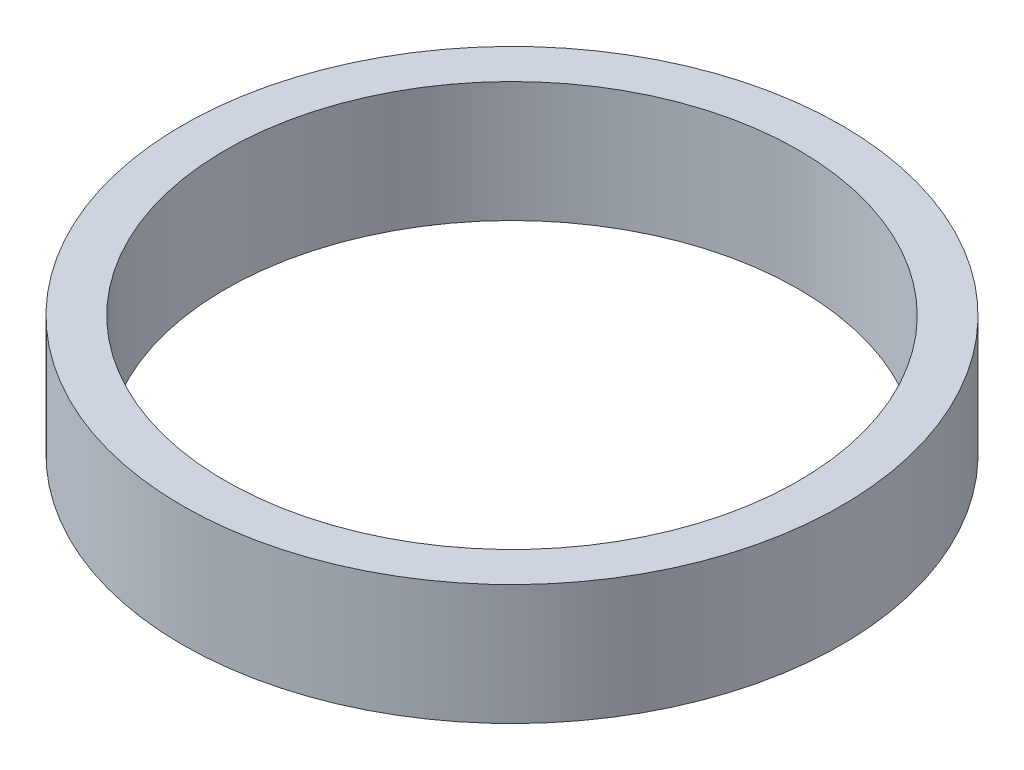
ISO-10303-21;
HEADER;
FILE_DESCRIPTION(('STEP AP214'),'2;1');
FILE_NAME('part.step','',(''),(''),'','','');
FILE_SCHEMA(('AUTOMOTIVE_DESIGN { 1 0 10303 214 1 1 1 1 }'));
ENDSEC;
DATA;
#1=APPLICATION_CONTEXT('core data for automotive mechanical design processes');
#2=APPLICATION_PROTOCOL_DEFINITION('international standard','automotive_design',2000,#1);
#3=PRODUCT_CONTEXT('',#1,'mechanical');
#4=PRODUCT('Part','Part','',(#3));
#5=PRODUCT_RELATED_PRODUCT_CATEGORY('part','',(#4));
#6=PRODUCT_DEFINITION_FORMATION('','',#4);
#7=PRODUCT_DEFINITION_CONTEXT('part definition',#1,'design');
#8=PRODUCT_DEFINITION('design','',#6,#7);
#9=PRODUCT_DEFINITION_SHAPE('','',#8);
#10=(LENGTH_UNIT() NAMED_UNIT(*) SI_UNIT(.MILLI.,.METRE.));
#11=(NAMED_UNIT(*) PLANE_ANGLE_UNIT() SI_UNIT($,.RADIAN.));
#12=(NAMED_UNIT(*) SI_UNIT($,.STERADIAN.) SOLID_ANGLE_UNIT());
#13=UNCERTAINTY_MEASURE_WITH_UNIT(LENGTH_MEASURE(1.E-05),#10,'distance_accuracy_value','');
#14=(GEOMETRIC_REPRESENTATION_CONTEXT(3) GLOBAL_UNCERTAINTY_ASSIGNED_CONTEXT((#13)) GLOBAL_UNIT_ASSIGNED_CONTEXT((#10,
#11,#12)) REPRESENTATION_CONTEXT('',''));
#15=CARTESIAN_POINT('',(0.,0.,0.));
#16=DIRECTION('',(0.,0.,1.));
#17=DIRECTION('',(1.,0.,0.));
#18=AXIS2_PLACEMENT_3D('',#15,#16,#17);
#19=CARTESIAN_POINT('',(0.,21.,0.));
#20=DIRECTION('',(0.,-1.,0.));
#21=DIRECTION('',(0.,0.,-1.));
#22=AXIS2_PLACEMENT_3D('',#19,#20,#21);
#23=CYLINDRICAL_SURFACE('',#22,57.5);
#24=CARTESIAN_POINT('',(0.,21.,0.));
#25=DIRECTION('',(0.,1.,0.));
#26=DIRECTION('',(0.,0.,1.));
#27=AXIS2_PLACEMENT_3D('',#24,#25,#26);
#28=CIRCLE('',#27,57.5);
#29=CARTESIAN_POINT('',(0.,21.,-57.5));
#30=VERTEX_POINT('',#29);
#31=EDGE_CURVE('E10',#30,#30,#28,.T.);
#32=CARTESIAN_POINT('',(0.,0.,0.));
#33=DIRECTION('',(0.,1.,0.));
#34=DIRECTION('',(0.,0.,1.));
#35=AXIS2_PLACEMENT_3D('',#32,#33,#34);
#36=CIRCLE('',#35,57.5);
#37=CARTESIAN_POINT('',(0.,0.,-57.5));
#38=VERTEX_POINT('',#37);
#39=EDGE_CURVE('E37',#38,#38,#36,.T.);
#40=CARTESIAN_POINT('',(0.,21.,-57.5));
#41=CARTESIAN_POINT('',(0.,20.78125,-57.5));
#42=CARTESIAN_POINT('',(0.,20.5625,-57.5));
#43=CARTESIAN_POINT('',(0.,20.125,-57.5));
#44=CARTESIAN_POINT('',(0.,19.90625,-57.5));
#45=CARTESIAN_POINT('',(0.,19.46875,-57.5));
#46=CARTESIAN_POINT('',(0.,19.25,-57.5));
#47=CARTESIAN_POINT('',(0.,18.8125,-57.5));
#48=CARTESIAN_POINT('',(0.,18.59375,-57.5));
#49=CARTESIAN_POINT('',(0.,18.15625,-57.5));
#50=CARTESIAN_POINT('',(0.,17.9375,-57.5));
#51=CARTESIAN_POINT('',(0.,17.5,-57.5));
#52=CARTESIAN_POINT('',(0.,17.28125,-57.5));
#53=CARTESIAN_POINT('',(0.,16.84375,-57.5));
#54=CARTESIAN_POINT('',(0.,16.625,-57.5));
#55=CARTESIAN_POINT('',(0.,16.1875,-57.5));
#56=CARTESIAN_POINT('',(0.,15.96875,-57.5));
#57=CARTESIAN_POINT('',(0.,15.53125,-57.5));
#58=CARTESIAN_POINT('',(0.,15.3125,-57.5));
#59=CARTESIAN_POINT('',(0.,14.875,-57.5));
#60=CARTESIAN_POINT('',(0.,14.65625,-57.5));
#61=CARTESIAN_POINT('',(0.,14.21875,-57.5));
#62=CARTESIAN_POINT('',(0.,14.,-57.5));
#63=CARTESIAN_POINT('',(0.,13.5625,-57.5));
#64=CARTESIAN_POINT('',(0.,13.34375,-57.5));
#65=CARTESIAN_POINT('',(0.,12.90625,-57.5));
#66=CARTESIAN_POINT('',(0.,12.6875,-57.5));
#67=CARTESIAN_POINT('',(0.,12.25,-57.5));
#68=CARTESIAN_POINT('',(0.,12.03125,-57.5));
#69=CARTESIAN_POINT('',(0.,11.59375,-57.5));
#70=CARTESIAN_POINT('',(0.,11.375,-57.5));
#71=CARTESIAN_POINT('',(0.,10.9375,-57.5));
#72=CARTESIAN_POINT('',(0.,10.71875,-57.5));
#73=CARTESIAN_POINT('',(0.,10.28125,-57.5));
#74=CARTESIAN_POINT('',(0.,10.0625,-57.5));
#75=CARTESIAN_POINT('',(0.,9.625,-57.5));
#76=CARTESIAN_POINT('',(0.,9.40625,-57.5));
#77=CARTESIAN_POINT('',(0.,8.96875,-57.5));
#78=CARTESIAN_POINT('',(0.,8.75,-57.5));
#79=CARTESIAN_POINT('',(0.,8.3125,-57.5));
#80=CARTESIAN_POINT('',(0.,8.09375,-57.5));
#81=CARTESIAN_POINT('',(0.,7.65625,-57.5));
#82=CARTESIAN_POINT('',(0.,7.4375,-57.5));
#83=CARTESIAN_POINT('',(0.,7.,-57.5));
#84=CARTESIAN_POINT('',(0.,6.78125,-57.5));
#85=CARTESIAN_POINT('',(0.,6.34375,-57.5));
#86=CARTESIAN_POINT('',(0.,6.125,-57.5));
#87=CARTESIAN_POINT('',(0.,5.6875,-57.5));
#88=CARTESIAN_POINT('',(0.,5.46875,-57.5));
#89=CARTESIAN_POINT('',(0.,5.03125,-57.5));
#90=CARTESIAN_POINT('',(0.,4.8125,-57.5));
#91=CARTESIAN_POINT('',(0.,4.375,-57.5));
#92=CARTESIAN_POINT('',(0.,4.15625,-57.5));
#93=CARTESIAN_POINT('',(0.,3.71875,-57.5));
#94=CARTESIAN_POINT('',(0.,3.5,-57.5));
#95=CARTESIAN_POINT('',(0.,3.0625,-57.5));
#96=CARTESIAN_POINT('',(0.,2.84375,-57.5));
#97=CARTESIAN_POINT('',(0.,2.40625,-57.5));
#98=CARTESIAN_POINT('',(0.,2.1875,-57.5));
#99=CARTESIAN_POINT('',(0.,1.75,-57.5));
#100=CARTESIAN_POINT('',(0.,1.53125,-57.5));
#101=CARTESIAN_POINT('',(0.,1.09375,-57.5));
#102=CARTESIAN_POINT('',(0.,0.875000000000001,-57.5));
#103=CARTESIAN_POINT('',(0.,0.4375,-57.5));
#104=CARTESIAN_POINT('',(0.,0.21875,-57.5));
#105=CARTESIAN_POINT('',(0.,0.,-57.5));
#106=B_SPLINE_CURVE_WITH_KNOTS('',3,(#40,#41,#42,#43,#44,#45,#46,#47,#48,#49,#50,#51,#52,#53,
#54,#55,#56,#57,#58,#59,#60,#61,#62,#63,#64,#65,#66,#67,#68,#69,#70,#71,#72,#73,#74,#75,#76,#77,
#78,#79,#80,#81,#82,#83,#84,#85,#86,#87,#88,#89,#90,#91,#92,#93,#94,#95,#96,#97,#98,#99,#100,
#101,#102,#103,#104,#105),.UNSPECIFIED.,.F.,.F.,(4,2,2,2,2,2,2,2,2,2,2,2,2,2,2,2,2,2,2,2,2,2,2,
2,2,2,2,2,2,2,2,2,4),(0.,0.656250000000001,1.3125,1.96875,2.625,3.28125,3.9375,4.59375,5.25,
5.90625,6.5625,7.21875,7.875,8.53125,9.1875,9.84375,10.5,11.15625,11.8125,12.46875,13.125,
13.78125,14.4375,15.09375,15.75,16.40625,17.0625,17.71875,18.375,19.03125,19.6875,20.34375,21.),.UNSPECIFIED.);
#107=EDGE_CURVE('BSEAM40',#30,#38,#106,.T.);
#108=ORIENTED_EDGE('',*,*,#31,.F.);
#109=ORIENTED_EDGE('',*,*,#39,.T.);
#110=ORIENTED_EDGE('',*,*,#107,.T.);
#111=ORIENTED_EDGE('',*,*,#107,.F.);
#112=EDGE_LOOP('',(#108,#110,#109,#111));
#113=FACE_BOUND('',#112,.T.);
#114=ADVANCED_FACE('F40',(#113),#23,.T.);
#115=CARTESIAN_POINT('',(0.,21.,0.));
#116=DIRECTION('',(0.,1.,0.));
#117=DIRECTION('',(0.,0.,1.));
#118=AXIS2_PLACEMENT_3D('',#115,#116,#117);
#119=PLANE('',#118);
#120=CARTESIAN_POINT('',(0.,21.,0.));
#121=DIRECTION('',(0.,1.,0.));
#122=DIRECTION('',(0.,0.,1.));
#123=AXIS2_PLACEMENT_3D('',#120,#121,#122);
#124=CIRCLE('',#123,50.);
#125=CARTESIAN_POINT('',(0.,21.,-50.));
#126=VERTEX_POINT('',#125);
#127=EDGE_CURVE('E50',#126,#126,#124,.T.);
#128=ORIENTED_EDGE('',*,*,#127,.F.);
#129=EDGE_LOOP('',(#128));
#130=FACE_BOUND('',#129,.T.);
#131=ORIENTED_EDGE('',*,*,#31,.T.);
#132=EDGE_LOOP('',(#131));
#133=FACE_BOUND('',#132,.T.);
#134=ADVANCED_FACE('F59',(#130,#133),#119,.T.);
#135=CARTESIAN_POINT('',(0.,0.,0.));
#136=DIRECTION('',(0.,1.,0.));
#137=DIRECTION('',(0.,0.,1.));
#138=AXIS2_PLACEMENT_3D('',#135,#136,#137);
#139=PLANE('',#138);
#140=CARTESIAN_POINT('',(0.,0.,0.));
#141=DIRECTION('',(0.,1.,0.));
#142=DIRECTION('',(0.,0.,1.));
#143=AXIS2_PLACEMENT_3D('',#140,#141,#142);
#144=CIRCLE('',#143,50.);
#145=CARTESIAN_POINT('',(0.,0.,-50.));
#146=VERTEX_POINT('',#145);
#147=EDGE_CURVE('E47',#146,#146,#144,.T.);
#148=ORIENTED_EDGE('',*,*,#147,.T.);
#149=EDGE_LOOP('',(#148));
#150=FACE_BOUND('',#149,.T.);
#151=ORIENTED_EDGE('',*,*,#39,.F.);
#152=EDGE_LOOP('',(#151));
#153=FACE_BOUND('',#152,.T.);
#154=ADVANCED_FACE('F58',(#150,#153),#139,.F.);
#155=CARTESIAN_POINT('',(0.,21.,0.));
#156=DIRECTION('',(0.,-1.,0.));
#157=DIRECTION('',(0.,0.,-1.));
#158=AXIS2_PLACEMENT_3D('',#155,#156,#157);
#159=CYLINDRICAL_SURFACE('',#158,50.);
#160=CARTESIAN_POINT('',(0.,21.,-50.));
#161=CARTESIAN_POINT('',(0.,20.78125,-50.));
#162=CARTESIAN_POINT('',(0.,20.5625,-50.));
#163=CARTESIAN_POINT('',(0.,20.125,-50.));
#164=CARTESIAN_POINT('',(0.,19.90625,-50.));
#165=CARTESIAN_POINT('',(0.,19.46875,-50.));
#166=CARTESIAN_POINT('',(0.,19.25,-50.));
#167=CARTESIAN_POINT('',(0.,18.8125,-50.));
#168=CARTESIAN_POINT('',(0.,18.59375,-50.));
#169=CARTESIAN_POINT('',(0.,18.15625,-50.));
#170=CARTESIAN_POINT('',(0.,17.9375,-50.));
#171=CARTESIAN_POINT('',(0.,17.5,-50.));
#172=CARTESIAN_POINT('',(0.,17.28125,-50.));
#173=CARTESIAN_POINT('',(0.,16.84375,-50.));
#174=CARTESIAN_POINT('',(0.,16.625,-50.));
#175=CARTESIAN_POINT('',(0.,16.1875,-50.));
#176=CARTESIAN_POINT('',(0.,15.96875,-50.));
#177=CARTESIAN_POINT('',(0.,15.53125,-50.));
#178=CARTESIAN_POINT('',(0.,15.3125,-50.));
#179=CARTESIAN_POINT('',(0.,14.875,-50.));
#180=CARTESIAN_POINT('',(0.,14.65625,-50.));
#181=CARTESIAN_POINT('',(0.,14.21875,-50.));
#182=CARTESIAN_POINT('',(0.,14.,-50.));
#183=CARTESIAN_POINT('',(0.,13.5625,-50.));
#184=CARTESIAN_POINT('',(0.,13.34375,-50.));
#185=CARTESIAN_POINT('',(0.,12.90625,-50.));
#186=CARTESIAN_POINT('',(0.,12.6875,-50.));
#187=CARTESIAN_POINT('',(0.,12.25,-50.));
#188=CARTESIAN_POINT('',(0.,12.03125,-50.));
#189=CARTESIAN_POINT('',(0.,11.59375,-50.));
#190=CARTESIAN_POINT('',(0.,11.375,-50.));
#191=CARTESIAN_POINT('',(0.,10.9375,-50.));
#192=CARTESIAN_POINT('',(0.,10.71875,-50.));
#193=CARTESIAN_POINT('',(0.,10.28125,-50.));
#194=CARTESIAN_POINT('',(0.,10.0625,-50.));
#195=CARTESIAN_POINT('',(0.,9.625,-50.));
#196=CARTESIAN_POINT('',(0.,9.40625,-50.));
#197=CARTESIAN_POINT('',(0.,8.96875,-50.));
#198=CARTESIAN_POINT('',(0.,8.75,-50.));
#199=CARTESIAN_POINT('',(0.,8.3125,-50.));
#200=CARTESIAN_POINT('',(0.,8.09375,-50.));
#201=CARTESIAN_POINT('',(0.,7.65625,-50.));
#202=CARTESIAN_POINT('',(0.,7.4375,-50.));
#203=CARTESIAN_POINT('',(0.,7.,-50.));
#204=CARTESIAN_POINT('',(0.,6.78125,-50.));
#205=CARTESIAN_POINT('',(0.,6.34375,-50.));
#206=CARTESIAN_POINT('',(0.,6.125,-50.));
#207=CARTESIAN_POINT('',(0.,5.6875,-50.));
#208=CARTESIAN_POINT('',(0.,5.46875,-50.));
#209=CARTESIAN_POINT('',(0.,5.03125,-50.));
#210=CARTESIAN_POINT('',(0.,4.8125,-50.));
#211=CARTESIAN_POINT('',(0.,4.375,-50.));
#212=CARTESIAN_POINT('',(0.,4.15625,-50.));
#213=CARTESIAN_POINT('',(0.,3.71875,-50.));
#214=CARTESIAN_POINT('',(0.,3.5,-50.));
#215=CARTESIAN_POINT('',(0.,3.0625,-50.));
#216=CARTESIAN_POINT('',(0.,2.84375,-50.));
#217=CARTESIAN_POINT('',(0.,2.40625,-50.));
#218=CARTESIAN_POINT('',(0.,2.1875,-50.));
#219=CARTESIAN_POINT('',(0.,1.75,-50.));
#220=CARTESIAN_POINT('',(0.,1.53125,-50.));
#221=CARTESIAN_POINT('',(0.,1.09375,-50.));
#222=CARTESIAN_POINT('',(0.,0.875000000000001,-50.));
#223=CARTESIAN_POINT('',(0.,0.4375,-50.));
#224=CARTESIAN_POINT('',(0.,0.21875,-50.));
#225=CARTESIAN_POINT('',(0.,0.,-50.));
#226=B_SPLINE_CURVE_WITH_KNOTS('',3,(#160,#161,#162,#163,#164,#165,#166,#167,#168,#169,#170,
#171,#172,#173,#174,#175,#176,#177,#178,#179,#180,#181,#182,#183,#184,#185,#186,#187,#188,#189,
#190,#191,#192,#193,#194,#195,#196,#197,#198,#199,#200,#201,#202,#203,#204,#205,#206,#207,#208,
#209,#210,#211,#212,#213,#214,#215,#216,#217,#218,#219,#220,#221,#222,#223,#224,#225),
.UNSPECIFIED.,.F.,.F.,(4,2,2,2,2,2,2,2,2,2,2,2,2,2,2,2,2,2,2,2,2,2,2,2,2,2,2,2,2,2,2,2,4),(0.,
0.656249999999997,1.3125,1.96875,2.625,3.28125,3.9375,4.59375,5.25,5.90625,6.5625,7.21875,7.875,
8.53125,9.1875,9.84375,10.5,11.15625,11.8125,12.46875,13.125,13.78125,14.4375,15.09375,15.75,
16.40625,17.0625,17.71875,18.375,19.03125,19.6875,20.34375,21.),.UNSPECIFIED.);
#227=EDGE_CURVE('BSEAM54',#126,#146,#226,.T.);
#228=ORIENTED_EDGE('',*,*,#127,.T.);
#229=ORIENTED_EDGE('',*,*,#147,.F.);
#230=ORIENTED_EDGE('',*,*,#227,.T.);
#231=ORIENTED_EDGE('',*,*,#227,.F.);
#232=EDGE_LOOP('',(#228,#230,#229,#231));
#233=FACE_BOUND('',#232,.T.);
#234=ADVANCED_FACE('F54',(#233),#159,.F.);
#235=CLOSED_SHELL('',(#114,#134,#154,#234));
#236=MANIFOLD_SOLID_BREP('B2',#235);
#237=ADVANCED_BREP_SHAPE_REPRESENTATION('',(#18,#236),#14);
#238=SHAPE_DEFINITION_REPRESENTATION(#9,#237);
ENDSEC;
END-ISO-10303-21;
